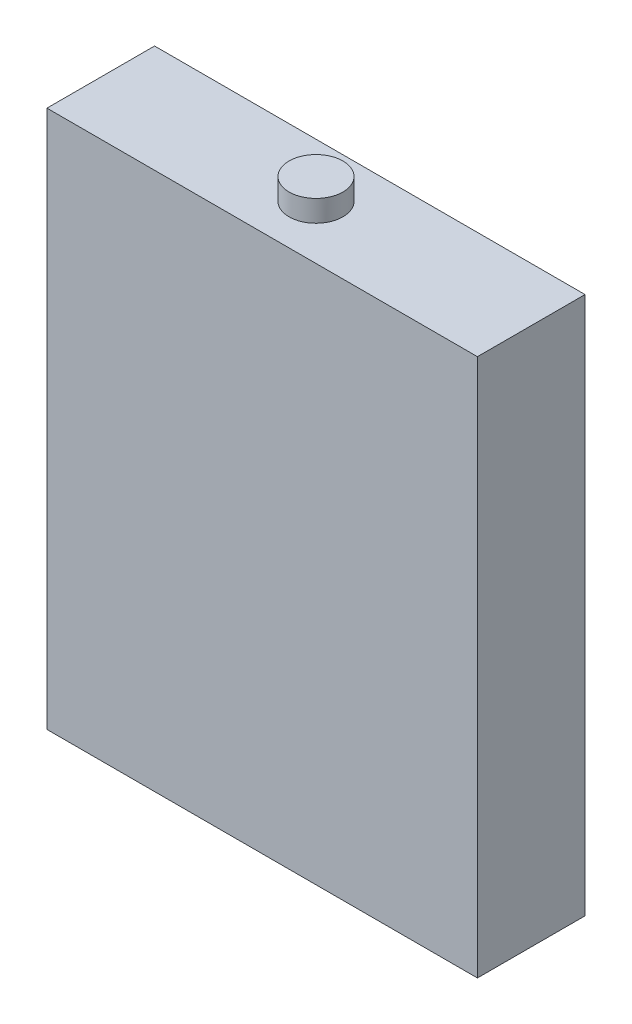
ISO-10303-21;
HEADER;
FILE_DESCRIPTION(('STEP AP214'),'2;1');
FILE_NAME('part.step','',(''),(''),'','','');
FILE_SCHEMA(('AUTOMOTIVE_DESIGN { 1 0 10303 214 1 1 1 1 }'));
ENDSEC;
DATA;
#1=APPLICATION_CONTEXT('core data for automotive mechanical design processes');
#2=APPLICATION_PROTOCOL_DEFINITION('international standard','automotive_design',2000,#1);
#3=PRODUCT_CONTEXT('',#1,'mechanical');
#4=PRODUCT('Part','Part','',(#3));
#5=PRODUCT_RELATED_PRODUCT_CATEGORY('part','',(#4));
#6=PRODUCT_DEFINITION_FORMATION('','',#4);
#7=PRODUCT_DEFINITION_CONTEXT('part definition',#1,'design');
#8=PRODUCT_DEFINITION('design','',#6,#7);
#9=PRODUCT_DEFINITION_SHAPE('','',#8);
#10=(LENGTH_UNIT() NAMED_UNIT(*) SI_UNIT(.MILLI.,.METRE.));
#11=(NAMED_UNIT(*) PLANE_ANGLE_UNIT() SI_UNIT($,.RADIAN.));
#12=(NAMED_UNIT(*) SI_UNIT($,.STERADIAN.) SOLID_ANGLE_UNIT());
#13=UNCERTAINTY_MEASURE_WITH_UNIT(LENGTH_MEASURE(1.E-05),#10,'distance_accuracy_value','');
#14=(GEOMETRIC_REPRESENTATION_CONTEXT(3) GLOBAL_UNCERTAINTY_ASSIGNED_CONTEXT((#13)) GLOBAL_UNIT_ASSIGNED_CONTEXT((#10,
#11,#12)) REPRESENTATION_CONTEXT('',''));
#15=CARTESIAN_POINT('',(0.,0.,0.));
#16=DIRECTION('',(0.,0.,1.));
#17=DIRECTION('',(1.,0.,0.));
#18=AXIS2_PLACEMENT_3D('',#15,#16,#17);
#19=CARTESIAN_POINT('',(20.,50.,5.));
#20=DIRECTION('',(-1.,0.,0.));
#21=DIRECTION('',(0.,0.,1.));
#22=AXIS2_PLACEMENT_3D('',#19,#20,#21);
#23=PLANE('',#22);
#24=DIRECTION('',(0.,0.,-1.));
#25=VECTOR('',#24,1.);
#26=CARTESIAN_POINT('',(20.,0.,5.));
#27=LINE('',#26,#25);
#28=CARTESIAN_POINT('',(20.,0.,5.));
#29=VERTEX_POINT('',#28);
#30=CARTESIAN_POINT('',(20.,0.,-5.));
#31=VERTEX_POINT('',#30);
#32=EDGE_CURVE('E114',#29,#31,#27,.T.);
#33=ORIENTED_EDGE('',*,*,#32,.T.);
#34=DIRECTION('',(0.,-1.,0.));
#35=VECTOR('',#34,1.);
#36=CARTESIAN_POINT('',(20.,50.,-5.));
#37=LINE('',#36,#35);
#38=CARTESIAN_POINT('',(20.,50.,-5.));
#39=VERTEX_POINT('',#38);
#40=EDGE_CURVE('E52',#39,#31,#37,.T.);
#41=ORIENTED_EDGE('',*,*,#40,.F.);
#42=DIRECTION('',(0.,0.,-1.));
#43=VECTOR('',#42,1.);
#44=CARTESIAN_POINT('',(20.,50.,5.));
#45=LINE('',#44,#43);
#46=CARTESIAN_POINT('',(20.,50.,5.));
#47=VERTEX_POINT('',#46);
#48=EDGE_CURVE('E96',#47,#39,#45,.T.);
#49=ORIENTED_EDGE('',*,*,#48,.F.);
#50=DIRECTION('',(0.,-1.,0.));
#51=VECTOR('',#50,1.);
#52=CARTESIAN_POINT('',(20.,50.,5.));
#53=LINE('',#52,#51);
#54=EDGE_CURVE('E110',#47,#29,#53,.T.);
#55=ORIENTED_EDGE('',*,*,#54,.T.);
#56=EDGE_LOOP('',(#33,#41,#49,#55));
#57=FACE_BOUND('',#56,.T.);
#58=ADVANCED_FACE('F43',(#57),#23,.F.);
#59=CARTESIAN_POINT('',(-20.,50.,-5.));
#60=DIRECTION('',(0.,0.,1.));
#61=DIRECTION('',(1.,0.,0.));
#62=AXIS2_PLACEMENT_3D('',#59,#60,#61);
#63=PLANE('',#62);
#64=DIRECTION('',(-1.,0.,0.));
#65=VECTOR('',#64,1.);
#66=CARTESIAN_POINT('',(-20.,0.,-5.));
#67=LINE('',#66,#65);
#68=CARTESIAN_POINT('',(-20.,0.,-5.));
#69=VERTEX_POINT('',#68);
#70=EDGE_CURVE('E102',#31,#69,#67,.T.);
#71=ORIENTED_EDGE('',*,*,#70,.T.);
#72=DIRECTION('',(0.,-1.,0.));
#73=VECTOR('',#72,1.);
#74=CARTESIAN_POINT('',(-20.,50.,-5.));
#75=LINE('',#74,#73);
#76=CARTESIAN_POINT('',(-20.,50.,-5.));
#77=VERTEX_POINT('',#76);
#78=EDGE_CURVE('E100',#77,#69,#75,.T.);
#79=ORIENTED_EDGE('',*,*,#78,.F.);
#80=DIRECTION('',(-1.,0.,0.));
#81=VECTOR('',#80,1.);
#82=CARTESIAN_POINT('',(-20.,50.,-5.));
#83=LINE('',#82,#81);
#84=EDGE_CURVE('E91',#39,#77,#83,.T.);
#85=ORIENTED_EDGE('',*,*,#84,.F.);
#86=ORIENTED_EDGE('',*,*,#40,.T.);
#87=EDGE_LOOP('',(#71,#79,#85,#86));
#88=FACE_BOUND('',#87,.T.);
#89=ADVANCED_FACE('F101',(#88),#63,.F.);
#90=CARTESIAN_POINT('',(-20.,50.,5.));
#91=DIRECTION('',(1.,0.,0.));
#92=DIRECTION('',(0.,0.,-1.));
#93=AXIS2_PLACEMENT_3D('',#90,#91,#92);
#94=PLANE('',#93);
#95=DIRECTION('',(0.,0.,1.));
#96=VECTOR('',#95,1.);
#97=CARTESIAN_POINT('',(-20.,0.,5.));
#98=LINE('',#97,#96);
#99=CARTESIAN_POINT('',(-20.,0.,5.));
#100=VERTEX_POINT('',#99);
#101=EDGE_CURVE('E77',#69,#100,#98,.T.);
#102=ORIENTED_EDGE('',*,*,#101,.T.);
#103=DIRECTION('',(0.,-1.,0.));
#104=VECTOR('',#103,1.);
#105=CARTESIAN_POINT('',(-20.,50.,5.));
#106=LINE('',#105,#104);
#107=CARTESIAN_POINT('',(-20.,50.,5.));
#108=VERTEX_POINT('',#107);
#109=EDGE_CURVE('E104',#108,#100,#106,.T.);
#110=ORIENTED_EDGE('',*,*,#109,.F.);
#111=DIRECTION('',(0.,0.,1.));
#112=VECTOR('',#111,1.);
#113=CARTESIAN_POINT('',(-20.,50.,5.));
#114=LINE('',#113,#112);
#115=EDGE_CURVE('E94',#77,#108,#114,.T.);
#116=ORIENTED_EDGE('',*,*,#115,.F.);
#117=ORIENTED_EDGE('',*,*,#78,.T.);
#118=EDGE_LOOP('',(#102,#110,#116,#117));
#119=FACE_BOUND('',#118,.T.);
#120=ADVANCED_FACE('F106',(#119),#94,.F.);
#121=CARTESIAN_POINT('',(-20.,50.,5.));
#122=DIRECTION('',(0.,0.,-1.));
#123=DIRECTION('',(-1.,0.,0.));
#124=AXIS2_PLACEMENT_3D('',#121,#122,#123);
#125=PLANE('',#124);
#126=DIRECTION('',(1.,0.,0.));
#127=VECTOR('',#126,1.);
#128=CARTESIAN_POINT('',(-20.,0.,5.));
#129=LINE('',#128,#127);
#130=EDGE_CURVE('E83',#100,#29,#129,.T.);
#131=ORIENTED_EDGE('',*,*,#130,.T.);
#132=ORIENTED_EDGE('',*,*,#54,.F.);
#133=DIRECTION('',(1.,0.,0.));
#134=VECTOR('',#133,1.);
#135=CARTESIAN_POINT('',(-20.,50.,5.));
#136=LINE('',#135,#134);
#137=EDGE_CURVE('E60',#108,#47,#136,.T.);
#138=ORIENTED_EDGE('',*,*,#137,.F.);
#139=ORIENTED_EDGE('',*,*,#109,.T.);
#140=EDGE_LOOP('',(#131,#132,#138,#139));
#141=FACE_BOUND('',#140,.T.);
#142=ADVANCED_FACE('F143',(#141),#125,.F.);
#143=CARTESIAN_POINT('',(0.,50.,0.));
#144=DIRECTION('',(0.,-1.,0.));
#145=DIRECTION('',(0.,0.,-1.));
#146=AXIS2_PLACEMENT_3D('',#143,#144,#145);
#147=PLANE('',#146);
#148=CARTESIAN_POINT('',(0.,50.,0.));
#149=DIRECTION('',(0.,-1.,0.));
#150=DIRECTION('',(0.,0.,-1.));
#151=AXIS2_PLACEMENT_3D('',#148,#149,#150);
#152=CIRCLE('',#151,2.5);
#153=CARTESIAN_POINT('',(0.,50.,-2.5));
#154=VERTEX_POINT('',#153);
#155=EDGE_CURVE('E11',#154,#154,#152,.F.);
#156=ORIENTED_EDGE('',*,*,#155,.F.);
#157=EDGE_LOOP('',(#156));
#158=FACE_BOUND('',#157,.T.);
#159=ORIENTED_EDGE('',*,*,#48,.T.);
#160=ORIENTED_EDGE('',*,*,#84,.T.);
#161=ORIENTED_EDGE('',*,*,#115,.T.);
#162=ORIENTED_EDGE('',*,*,#137,.T.);
#163=EDGE_LOOP('',(#159,#160,#161,#162));
#164=FACE_BOUND('',#163,.T.);
#165=ADVANCED_FACE('F92',(#158,#164),#147,.F.);
#166=CARTESIAN_POINT('',(0.,0.,0.));
#167=DIRECTION('',(0.,-1.,0.));
#168=DIRECTION('',(0.,0.,-1.));
#169=AXIS2_PLACEMENT_3D('',#166,#167,#168);
#170=PLANE('',#169);
#171=ORIENTED_EDGE('',*,*,#32,.F.);
#172=ORIENTED_EDGE('',*,*,#130,.F.);
#173=ORIENTED_EDGE('',*,*,#101,.F.);
#174=ORIENTED_EDGE('',*,*,#70,.F.);
#175=EDGE_LOOP('',(#171,#172,#173,#174));
#176=FACE_BOUND('',#175,.T.);
#177=ADVANCED_FACE('F132',(#176),#170,.T.);
#178=CARTESIAN_POINT('',(0.,52.,0.));
#179=DIRECTION('',(0.,-1.,0.));
#180=DIRECTION('',(0.,0.,-1.));
#181=AXIS2_PLACEMENT_3D('',#178,#179,#180);
#182=CYLINDRICAL_SURFACE('',#181,2.5);
#183=CARTESIAN_POINT('',(0.,52.,0.));
#184=DIRECTION('',(0.,1.,0.));
#185=DIRECTION('',(0.,0.,1.));
#186=AXIS2_PLACEMENT_3D('',#183,#184,#185);
#187=CIRCLE('',#186,2.5);
#188=CARTESIAN_POINT('',(0.,52.,2.5));
#189=VERTEX_POINT('',#188);
#190=EDGE_CURVE('E118',#189,#189,#187,.T.);
#191=ORIENTED_EDGE('',*,*,#190,.F.);
#192=EDGE_LOOP('',(#191));
#193=FACE_BOUND('',#192,.T.);
#194=ORIENTED_EDGE('',*,*,#155,.T.);
#195=EDGE_LOOP('',(#194));
#196=FACE_BOUND('',#195,.T.);
#197=ADVANCED_FACE('F134',(#193,#196),#182,.T.);
#198=CARTESIAN_POINT('',(0.,52.,0.));
#199=DIRECTION('',(0.,1.,0.));
#200=DIRECTION('',(0.,0.,1.));
#201=AXIS2_PLACEMENT_3D('',#198,#199,#200);
#202=PLANE('',#201);
#203=ORIENTED_EDGE('',*,*,#190,.T.);
#204=EDGE_LOOP('',(#203));
#205=FACE_BOUND('',#204,.T.);
#206=ADVANCED_FACE('F140',(#205),#202,.T.);
#207=CLOSED_SHELL('',(#58,#89,#120,#142,#165,#177,#197,#206));
#208=MANIFOLD_SOLID_BREP('B2',#207);
#209=ADVANCED_BREP_SHAPE_REPRESENTATION('',(#18,#208),#14);
#210=SHAPE_DEFINITION_REPRESENTATION(#9,#209);
ENDSEC;
END-ISO-10303-21;
